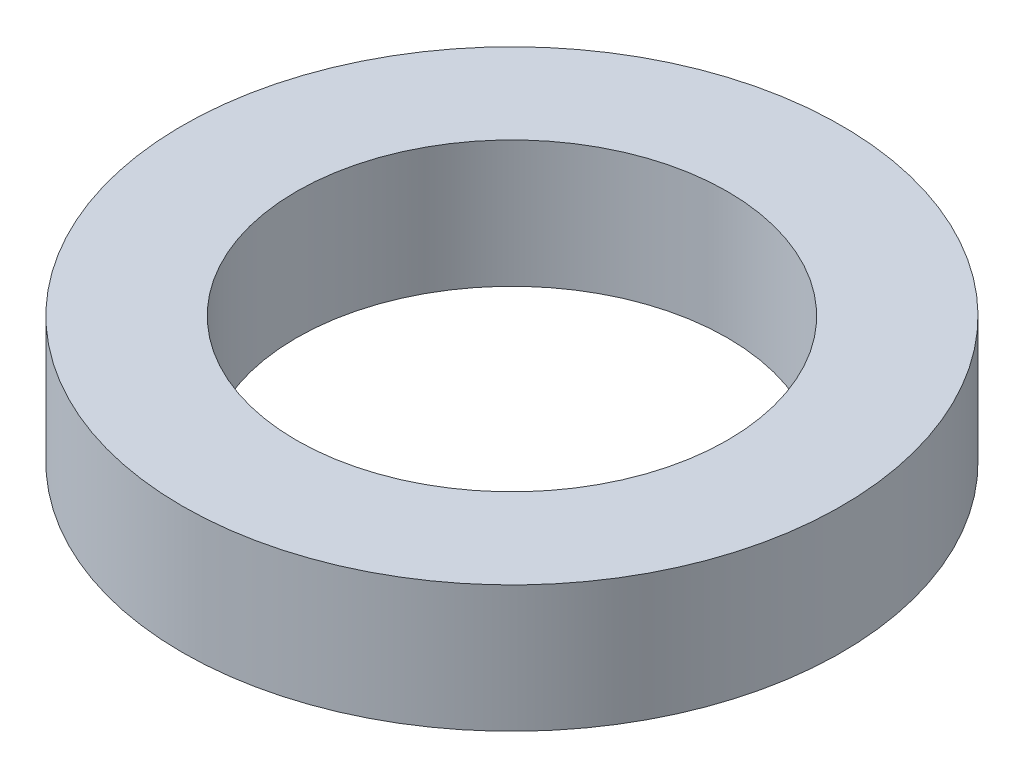
ISO-10303-21;
HEADER;
FILE_DESCRIPTION(('STEP AP214'),'2;1');
FILE_NAME('part.step','',(''),(''),'','','');
FILE_SCHEMA(('AUTOMOTIVE_DESIGN { 1 0 10303 214 1 1 1 1 }'));
ENDSEC;
DATA;
#1=APPLICATION_CONTEXT('core data for automotive mechanical design processes');
#2=APPLICATION_PROTOCOL_DEFINITION('international standard','automotive_design',2000,#1);
#3=PRODUCT_CONTEXT('',#1,'mechanical');
#4=PRODUCT('Part','Part','',(#3));
#5=PRODUCT_RELATED_PRODUCT_CATEGORY('part','',(#4));
#6=PRODUCT_DEFINITION_FORMATION('','',#4);
#7=PRODUCT_DEFINITION_CONTEXT('part definition',#1,'design');
#8=PRODUCT_DEFINITION('design','',#6,#7);
#9=PRODUCT_DEFINITION_SHAPE('','',#8);
#10=(LENGTH_UNIT() NAMED_UNIT(*) SI_UNIT(.MILLI.,.METRE.));
#11=(NAMED_UNIT(*) PLANE_ANGLE_UNIT() SI_UNIT($,.RADIAN.));
#12=(NAMED_UNIT(*) SI_UNIT($,.STERADIAN.) SOLID_ANGLE_UNIT());
#13=UNCERTAINTY_MEASURE_WITH_UNIT(LENGTH_MEASURE(1.E-05),#10,'distance_accuracy_value','');
#14=(GEOMETRIC_REPRESENTATION_CONTEXT(3) GLOBAL_UNCERTAINTY_ASSIGNED_CONTEXT((#13)) GLOBAL_UNIT_ASSIGNED_CONTEXT((#10,
#11,#12)) REPRESENTATION_CONTEXT('',''));
#15=CARTESIAN_POINT('',(0.,0.,0.));
#16=DIRECTION('',(0.,0.,1.));
#17=DIRECTION('',(1.,0.,0.));
#18=AXIS2_PLACEMENT_3D('',#15,#16,#17);
#19=CARTESIAN_POINT('',(0.,5.,0.));
#20=DIRECTION('',(0.,1.,0.));
#21=DIRECTION('',(0.,0.,1.));
#22=AXIS2_PLACEMENT_3D('',#19,#20,#21);
#23=PLANE('',#22);
#24=CARTESIAN_POINT('',(0.,5.,0.));
#25=DIRECTION('',(0.,1.,0.));
#26=DIRECTION('',(0.,0.,1.));
#27=AXIS2_PLACEMENT_3D('',#24,#25,#26);
#28=CIRCLE('',#27,13.);
#29=CARTESIAN_POINT('',(0.,5.,13.));
#30=VERTEX_POINT('',#29);
#31=EDGE_CURVE('E10',#30,#30,#28,.T.);
#32=ORIENTED_EDGE('',*,*,#31,.T.);
#33=EDGE_LOOP('',(#32));
#34=FACE_BOUND('',#33,.T.);
#35=CARTESIAN_POINT('',(0.,5.,0.));
#36=DIRECTION('',(0.,1.,0.));
#37=DIRECTION('',(0.,0.,1.));
#38=AXIS2_PLACEMENT_3D('',#35,#36,#37);
#39=CIRCLE('',#38,8.5);
#40=CARTESIAN_POINT('',(0.,5.,8.5));
#41=VERTEX_POINT('',#40);
#42=EDGE_CURVE('E46',#41,#41,#39,.T.);
#43=ORIENTED_EDGE('',*,*,#42,.F.);
#44=EDGE_LOOP('',(#43));
#45=FACE_BOUND('',#44,.T.);
#46=ADVANCED_FACE('F35',(#34,#45),#23,.T.);
#47=CARTESIAN_POINT('',(0.,0.,0.));
#48=DIRECTION('',(0.,1.,0.));
#49=DIRECTION('',(0.,0.,1.));
#50=AXIS2_PLACEMENT_3D('',#47,#48,#49);
#51=PLANE('',#50);
#52=CARTESIAN_POINT('',(0.,0.,0.));
#53=DIRECTION('',(0.,1.,0.));
#54=DIRECTION('',(0.,0.,1.));
#55=AXIS2_PLACEMENT_3D('',#52,#53,#54);
#56=CIRCLE('',#55,13.);
#57=CARTESIAN_POINT('',(0.,0.,13.));
#58=VERTEX_POINT('',#57);
#59=EDGE_CURVE('E39',#58,#58,#56,.T.);
#60=ORIENTED_EDGE('',*,*,#59,.F.);
#61=EDGE_LOOP('',(#60));
#62=FACE_BOUND('',#61,.T.);
#63=CARTESIAN_POINT('',(0.,0.,0.));
#64=DIRECTION('',(0.,1.,0.));
#65=DIRECTION('',(0.,0.,1.));
#66=AXIS2_PLACEMENT_3D('',#63,#64,#65);
#67=CIRCLE('',#66,8.5);
#68=CARTESIAN_POINT('',(0.,0.,8.5));
#69=VERTEX_POINT('',#68);
#70=EDGE_CURVE('E48',#69,#69,#67,.T.);
#71=ORIENTED_EDGE('',*,*,#70,.T.);
#72=EDGE_LOOP('',(#71));
#73=FACE_BOUND('',#72,.T.);
#74=ADVANCED_FACE('F58',(#62,#73),#51,.F.);
#75=CARTESIAN_POINT('',(0.,5.,0.));
#76=DIRECTION('',(0.,-1.,0.));
#77=DIRECTION('',(0.,0.,-1.));
#78=AXIS2_PLACEMENT_3D('',#75,#76,#77);
#79=CYLINDRICAL_SURFACE('',#78,13.);
#80=ORIENTED_EDGE('',*,*,#31,.F.);
#81=EDGE_LOOP('',(#80));
#82=FACE_BOUND('',#81,.T.);
#83=ORIENTED_EDGE('',*,*,#59,.T.);
#84=EDGE_LOOP('',(#83));
#85=FACE_BOUND('',#84,.T.);
#86=ADVANCED_FACE('F37',(#82,#85),#79,.T.);
#87=CARTESIAN_POINT('',(0.,5.,0.));
#88=DIRECTION('',(0.,-1.,0.));
#89=DIRECTION('',(0.,0.,-1.));
#90=AXIS2_PLACEMENT_3D('',#87,#88,#89);
#91=CYLINDRICAL_SURFACE('',#90,8.5);
#92=ORIENTED_EDGE('',*,*,#42,.T.);
#93=EDGE_LOOP('',(#92));
#94=FACE_BOUND('',#93,.T.);
#95=ORIENTED_EDGE('',*,*,#70,.F.);
#96=EDGE_LOOP('',(#95));
#97=FACE_BOUND('',#96,.T.);
#98=ADVANCED_FACE('F54',(#94,#97),#91,.F.);
#99=CLOSED_SHELL('',(#46,#74,#86,#98));
#100=MANIFOLD_SOLID_BREP('B2',#99);
#101=ADVANCED_BREP_SHAPE_REPRESENTATION('',(#18,#100),#14);
#102=SHAPE_DEFINITION_REPRESENTATION(#9,#101);
ENDSEC;
END-ISO-10303-21;
